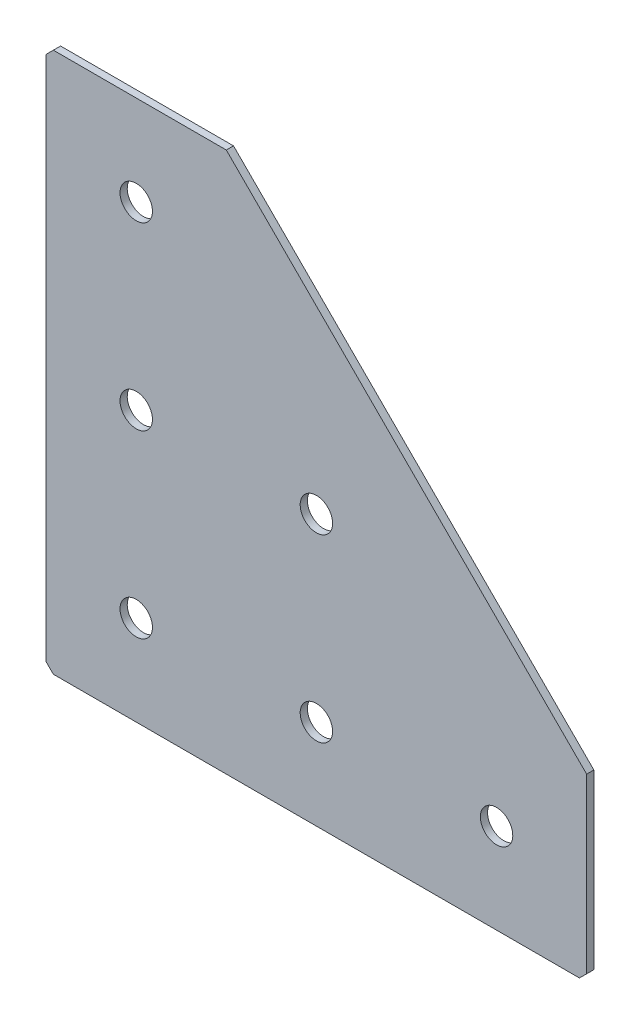
ISO-10303-21;
HEADER;
FILE_DESCRIPTION(('STEP AP214'),'2;1');
FILE_NAME('part.step','',(''),(''),'','','');
FILE_SCHEMA(('AUTOMOTIVE_DESIGN { 1 0 10303 214 1 1 1 1 }'));
ENDSEC;
DATA;
#1=APPLICATION_CONTEXT('core data for automotive mechanical design processes');
#2=APPLICATION_PROTOCOL_DEFINITION('international standard','automotive_design',2000,#1);
#3=PRODUCT_CONTEXT('',#1,'mechanical');
#4=PRODUCT('Part','Part','',(#3));
#5=PRODUCT_RELATED_PRODUCT_CATEGORY('part','',(#4));
#6=PRODUCT_DEFINITION_FORMATION('','',#4);
#7=PRODUCT_DEFINITION_CONTEXT('part definition',#1,'design');
#8=PRODUCT_DEFINITION('design','',#6,#7);
#9=PRODUCT_DEFINITION_SHAPE('','',#8);
#10=(LENGTH_UNIT() NAMED_UNIT(*) SI_UNIT(.MILLI.,.METRE.));
#11=(NAMED_UNIT(*) PLANE_ANGLE_UNIT() SI_UNIT($,.RADIAN.));
#12=(NAMED_UNIT(*) SI_UNIT($,.STERADIAN.) SOLID_ANGLE_UNIT());
#13=UNCERTAINTY_MEASURE_WITH_UNIT(LENGTH_MEASURE(1.E-05),#10,'distance_accuracy_value','');
#14=(GEOMETRIC_REPRESENTATION_CONTEXT(3) GLOBAL_UNCERTAINTY_ASSIGNED_CONTEXT((#13)) GLOBAL_UNIT_ASSIGNED_CONTEXT((#10,
#11,#12)) REPRESENTATION_CONTEXT('',''));
#15=CARTESIAN_POINT('',(0.,0.,0.));
#16=DIRECTION('',(0.,0.,1.));
#17=DIRECTION('',(1.,0.,0.));
#18=AXIS2_PLACEMENT_3D('',#15,#16,#17);
#19=CARTESIAN_POINT('',(50.,0.,-2.));
#20=DIRECTION('',(0.,-1.,0.));
#21=DIRECTION('',(1.,0.,0.));
#22=AXIS2_PLACEMENT_3D('',#19,#20,#21);
#23=PLANE('',#22);
#24=DIRECTION('',(1.,0.,0.));
#25=VECTOR('',#24,1.);
#26=CARTESIAN_POINT('',(50.,0.,-2.));
#27=LINE('',#26,#25);
#28=CARTESIAN_POINT('',(2.,0.,-2.));
#29=VERTEX_POINT('',#28);
#30=CARTESIAN_POINT('',(50.,0.,-2.));
#31=VERTEX_POINT('',#30);
#32=EDGE_CURVE('E112',#29,#31,#27,.T.);
#33=ORIENTED_EDGE('',*,*,#32,.F.);
#34=DIRECTION('',(0.,0.,1.));
#35=VECTOR('',#34,1.);
#36=CARTESIAN_POINT('',(2.,0.,-2.));
#37=LINE('',#36,#35);
#38=CARTESIAN_POINT('',(2.,0.,0.));
#39=VERTEX_POINT('',#38);
#40=EDGE_CURVE('E141',#29,#39,#37,.T.);
#41=ORIENTED_EDGE('',*,*,#40,.T.);
#42=DIRECTION('',(1.,0.,0.));
#43=VECTOR('',#42,1.);
#44=CARTESIAN_POINT('',(50.,0.,0.));
#45=LINE('',#44,#43);
#46=CARTESIAN_POINT('',(50.,0.,0.));
#47=VERTEX_POINT('',#46);
#48=EDGE_CURVE('E138',#39,#47,#45,.T.);
#49=ORIENTED_EDGE('',*,*,#48,.T.);
#50=DIRECTION('',(0.,0.,1.));
#51=VECTOR('',#50,1.);
#52=CARTESIAN_POINT('',(50.,0.,-2.));
#53=LINE('',#52,#51);
#54=EDGE_CURVE('E130',#31,#47,#53,.T.);
#55=ORIENTED_EDGE('',*,*,#54,.F.);
#56=EDGE_LOOP('',(#33,#41,#49,#55));
#57=FACE_BOUND('',#56,.T.);
#58=ADVANCED_FACE('F47',(#57),#23,.F.);
#59=CARTESIAN_POINT('',(150.,-100.,-2.));
#60=DIRECTION('',(-0.707106781186548,-0.707106781186548,0.));
#61=DIRECTION('',(0.707106781186548,-0.707106781186547,0.));
#62=AXIS2_PLACEMENT_3D('',#59,#60,#61);
#63=PLANE('',#62);
#64=DIRECTION('',(0.707106781186547,-0.707106781186547,0.));
#65=VECTOR('',#64,1.);
#66=CARTESIAN_POINT('',(150.,-100.,0.));
#67=LINE('',#66,#65);
#68=CARTESIAN_POINT('',(150.,-100.,0.));
#69=VERTEX_POINT('',#68);
#70=EDGE_CURVE('E199',#47,#69,#67,.T.);
#71=ORIENTED_EDGE('',*,*,#70,.T.);
#72=DIRECTION('',(0.,0.,1.));
#73=VECTOR('',#72,1.);
#74=CARTESIAN_POINT('',(150.,-100.,-2.));
#75=LINE('',#74,#73);
#76=CARTESIAN_POINT('',(150.,-100.,-2.));
#77=VERTEX_POINT('',#76);
#78=EDGE_CURVE('E132',#77,#69,#75,.T.);
#79=ORIENTED_EDGE('',*,*,#78,.F.);
#80=DIRECTION('',(0.707106781186547,-0.707106781186547,0.));
#81=VECTOR('',#80,1.);
#82=CARTESIAN_POINT('',(150.,-100.,-2.));
#83=LINE('',#82,#81);
#84=EDGE_CURVE('E116',#31,#77,#83,.T.);
#85=ORIENTED_EDGE('',*,*,#84,.F.);
#86=ORIENTED_EDGE('',*,*,#54,.T.);
#87=EDGE_LOOP('',(#71,#79,#85,#86));
#88=FACE_BOUND('',#87,.T.);
#89=ADVANCED_FACE('F129',(#88),#63,.F.);
#90=CARTESIAN_POINT('',(150.,-150.,-2.));
#91=DIRECTION('',(-1.,0.,0.));
#92=DIRECTION('',(0.,-1.,0.));
#93=AXIS2_PLACEMENT_3D('',#90,#91,#92);
#94=PLANE('',#93);
#95=DIRECTION('',(0.,-1.,0.));
#96=VECTOR('',#95,1.);
#97=CARTESIAN_POINT('',(150.,-150.,0.));
#98=LINE('',#97,#96);
#99=CARTESIAN_POINT('',(150.,-148.,0.));
#100=VERTEX_POINT('',#99);
#101=EDGE_CURVE('E192',#69,#100,#98,.T.);
#102=ORIENTED_EDGE('',*,*,#101,.T.);
#103=DIRECTION('',(0.,0.,-1.));
#104=VECTOR('',#103,1.);
#105=CARTESIAN_POINT('',(150.,-148.,-2.));
#106=LINE('',#105,#104);
#107=CARTESIAN_POINT('',(150.,-148.,-2.));
#108=VERTEX_POINT('',#107);
#109=EDGE_CURVE('E11',#100,#108,#106,.T.);
#110=ORIENTED_EDGE('',*,*,#109,.T.);
#111=DIRECTION('',(0.,-1.,0.));
#112=VECTOR('',#111,1.);
#113=CARTESIAN_POINT('',(150.,-150.,-2.));
#114=LINE('',#113,#112);
#115=EDGE_CURVE('E135',#77,#108,#114,.T.);
#116=ORIENTED_EDGE('',*,*,#115,.F.);
#117=ORIENTED_EDGE('',*,*,#78,.T.);
#118=EDGE_LOOP('',(#102,#110,#116,#117));
#119=FACE_BOUND('',#118,.T.);
#120=ADVANCED_FACE('F299',(#119),#94,.F.);
#121=CARTESIAN_POINT('',(0.,-150.,-2.));
#122=DIRECTION('',(0.,1.,0.));
#123=DIRECTION('',(0.,0.,1.));
#124=AXIS2_PLACEMENT_3D('',#121,#122,#123);
#125=PLANE('',#124);
#126=DIRECTION('',(-1.,0.,0.));
#127=VECTOR('',#126,1.);
#128=CARTESIAN_POINT('',(0.,-150.,-2.));
#129=LINE('',#128,#127);
#130=CARTESIAN_POINT('',(148.,-150.,-2.));
#131=VERTEX_POINT('',#130);
#132=CARTESIAN_POINT('',(2.,-150.,-2.));
#133=VERTEX_POINT('',#132);
#134=EDGE_CURVE('E184',#131,#133,#129,.T.);
#135=ORIENTED_EDGE('',*,*,#134,.F.);
#136=DIRECTION('',(0.,0.,1.));
#137=VECTOR('',#136,1.);
#138=CARTESIAN_POINT('',(148.,-150.,-2.));
#139=LINE('',#138,#137);
#140=CARTESIAN_POINT('',(148.,-150.,0.));
#141=VERTEX_POINT('',#140);
#142=EDGE_CURVE('E56',#131,#141,#139,.T.);
#143=ORIENTED_EDGE('',*,*,#142,.T.);
#144=DIRECTION('',(-1.,0.,0.));
#145=VECTOR('',#144,1.);
#146=CARTESIAN_POINT('',(0.,-150.,0.));
#147=LINE('',#146,#145);
#148=CARTESIAN_POINT('',(2.,-150.,0.));
#149=VERTEX_POINT('',#148);
#150=EDGE_CURVE('E183',#141,#149,#147,.T.);
#151=ORIENTED_EDGE('',*,*,#150,.T.);
#152=DIRECTION('',(0.,0.,-1.));
#153=VECTOR('',#152,1.);
#154=CARTESIAN_POINT('',(2.,-150.,-2.));
#155=LINE('',#154,#153);
#156=EDGE_CURVE('E63',#149,#133,#155,.T.);
#157=ORIENTED_EDGE('',*,*,#156,.T.);
#158=EDGE_LOOP('',(#135,#143,#151,#157));
#159=FACE_BOUND('',#158,.T.);
#160=ADVANCED_FACE('F182',(#159),#125,.F.);
#161=CARTESIAN_POINT('',(0.,0.,-2.));
#162=DIRECTION('',(1.,0.,0.));
#163=DIRECTION('',(0.,0.,-1.));
#164=AXIS2_PLACEMENT_3D('',#161,#162,#163);
#165=PLANE('',#164);
#166=DIRECTION('',(0.,1.,0.));
#167=VECTOR('',#166,1.);
#168=CARTESIAN_POINT('',(0.,0.,0.));
#169=LINE('',#168,#167);
#170=CARTESIAN_POINT('',(0.,-148.,0.));
#171=VERTEX_POINT('',#170);
#172=CARTESIAN_POINT('',(0.,-2.00000000000003,0.));
#173=VERTEX_POINT('',#172);
#174=EDGE_CURVE('E125',#171,#173,#169,.T.);
#175=ORIENTED_EDGE('',*,*,#174,.T.);
#176=DIRECTION('',(0.,0.,-1.));
#177=VECTOR('',#176,1.);
#178=CARTESIAN_POINT('',(0.,-2.00000000000003,-2.));
#179=LINE('',#178,#177);
#180=CARTESIAN_POINT('',(0.,-2.00000000000003,-2.));
#181=VERTEX_POINT('',#180);
#182=EDGE_CURVE('E165',#173,#181,#179,.T.);
#183=ORIENTED_EDGE('',*,*,#182,.T.);
#184=DIRECTION('',(0.,1.,0.));
#185=VECTOR('',#184,1.);
#186=CARTESIAN_POINT('',(0.,0.,-2.));
#187=LINE('',#186,#185);
#188=CARTESIAN_POINT('',(0.,-148.,-2.));
#189=VERTEX_POINT('',#188);
#190=EDGE_CURVE('E149',#189,#181,#187,.T.);
#191=ORIENTED_EDGE('',*,*,#190,.F.);
#192=DIRECTION('',(0.,0.,1.));
#193=VECTOR('',#192,1.);
#194=CARTESIAN_POINT('',(0.,-148.,-2.));
#195=LINE('',#194,#193);
#196=EDGE_CURVE('E161',#189,#171,#195,.T.);
#197=ORIENTED_EDGE('',*,*,#196,.T.);
#198=EDGE_LOOP('',(#175,#183,#191,#197));
#199=FACE_BOUND('',#198,.T.);
#200=ADVANCED_FACE('F267',(#199),#165,.F.);
#201=CARTESIAN_POINT('',(0.,0.,-2.));
#202=DIRECTION('',(0.,0.,1.));
#203=DIRECTION('',(1.,0.,0.));
#204=AXIS2_PLACEMENT_3D('',#201,#202,#203);
#205=PLANE('',#204);
#206=CARTESIAN_POINT('',(75.,-125.,-2.00000000000001));
#207=DIRECTION('',(0.,0.,-1.));
#208=DIRECTION('',(0.,1.,0.));
#209=AXIS2_PLACEMENT_3D('',#206,#207,#208);
#210=CIRCLE('',#209,4.5);
#211=CARTESIAN_POINT('',(75.,-120.5,-2.00000000000001));
#212=VERTEX_POINT('',#211);
#213=EDGE_CURVE('E256',#212,#212,#210,.T.);
#214=ORIENTED_EDGE('',*,*,#213,.F.);
#215=EDGE_LOOP('',(#214));
#216=FACE_BOUND('',#215,.T.);
#217=CARTESIAN_POINT('',(25.,-125.,-2.00000000000001));
#218=DIRECTION('',(0.,0.,-1.));
#219=DIRECTION('',(0.,1.,0.));
#220=AXIS2_PLACEMENT_3D('',#217,#218,#219);
#221=CIRCLE('',#220,4.5);
#222=CARTESIAN_POINT('',(25.,-120.5,-2.00000000000001));
#223=VERTEX_POINT('',#222);
#224=EDGE_CURVE('E248',#223,#223,#221,.T.);
#225=ORIENTED_EDGE('',*,*,#224,.F.);
#226=EDGE_LOOP('',(#225));
#227=FACE_BOUND('',#226,.T.);
#228=CARTESIAN_POINT('',(25.,-75.,-2.));
#229=DIRECTION('',(0.,0.,-1.));
#230=DIRECTION('',(0.,1.,0.));
#231=AXIS2_PLACEMENT_3D('',#228,#229,#230);
#232=CIRCLE('',#231,4.5);
#233=CARTESIAN_POINT('',(25.,-70.5,-2.));
#234=VERTEX_POINT('',#233);
#235=EDGE_CURVE('E240',#234,#234,#232,.T.);
#236=ORIENTED_EDGE('',*,*,#235,.F.);
#237=EDGE_LOOP('',(#236));
#238=FACE_BOUND('',#237,.T.);
#239=CARTESIAN_POINT('',(25.,-25.,-2.));
#240=DIRECTION('',(0.,0.,-1.));
#241=DIRECTION('',(0.,1.,0.));
#242=AXIS2_PLACEMENT_3D('',#239,#240,#241);
#243=CIRCLE('',#242,4.5);
#244=CARTESIAN_POINT('',(25.,-20.5,-2.));
#245=VERTEX_POINT('',#244);
#246=EDGE_CURVE('E232',#245,#245,#243,.T.);
#247=ORIENTED_EDGE('',*,*,#246,.F.);
#248=EDGE_LOOP('',(#247));
#249=FACE_BOUND('',#248,.T.);
#250=CARTESIAN_POINT('',(125.,-125.,-2.00000000000001));
#251=DIRECTION('',(0.,0.,-1.));
#252=DIRECTION('',(0.,1.,0.));
#253=AXIS2_PLACEMENT_3D('',#250,#251,#252);
#254=CIRCLE('',#253,4.5);
#255=CARTESIAN_POINT('',(125.,-120.5,-2.00000000000001));
#256=VERTEX_POINT('',#255);
#257=EDGE_CURVE('E224',#256,#256,#254,.T.);
#258=ORIENTED_EDGE('',*,*,#257,.F.);
#259=EDGE_LOOP('',(#258));
#260=FACE_BOUND('',#259,.T.);
#261=CARTESIAN_POINT('',(75.,-75.,-2.));
#262=DIRECTION('',(0.,0.,-1.));
#263=DIRECTION('',(0.,1.,0.));
#264=AXIS2_PLACEMENT_3D('',#261,#262,#263);
#265=CIRCLE('',#264,4.5);
#266=CARTESIAN_POINT('',(75.,-70.5,-2.));
#267=VERTEX_POINT('',#266);
#268=EDGE_CURVE('E216',#267,#267,#265,.T.);
#269=ORIENTED_EDGE('',*,*,#268,.F.);
#270=EDGE_LOOP('',(#269));
#271=FACE_BOUND('',#270,.T.);
#272=ORIENTED_EDGE('',*,*,#190,.T.);
#273=DIRECTION('',(-0.707106781186543,-0.707106781186552,0.));
#274=VECTOR('',#273,1.);
#275=CARTESIAN_POINT('',(2.,0.,-2.));
#276=LINE('',#275,#274);
#277=EDGE_CURVE('E119',#181,#29,#276,.F.);
#278=ORIENTED_EDGE('',*,*,#277,.T.);
#279=ORIENTED_EDGE('',*,*,#32,.T.);
#280=ORIENTED_EDGE('',*,*,#84,.T.);
#281=ORIENTED_EDGE('',*,*,#115,.T.);
#282=DIRECTION('',(0.707106781186548,0.707106781186548,0.));
#283=VECTOR('',#282,1.);
#284=CARTESIAN_POINT('',(148.,-150.,-2.));
#285=LINE('',#284,#283);
#286=EDGE_CURVE('E70',#108,#131,#285,.F.);
#287=ORIENTED_EDGE('',*,*,#286,.T.);
#288=ORIENTED_EDGE('',*,*,#134,.T.);
#289=DIRECTION('',(0.707106781186548,-0.707106781186548,0.));
#290=VECTOR('',#289,1.);
#291=CARTESIAN_POINT('',(0.,-148.,-2.));
#292=LINE('',#291,#290);
#293=EDGE_CURVE('E168',#133,#189,#292,.F.);
#294=ORIENTED_EDGE('',*,*,#293,.T.);
#295=EDGE_LOOP('',(#272,#278,#279,#280,#281,#287,#288,#294));
#296=FACE_BOUND('',#295,.T.);
#297=ADVANCED_FACE('F115',(#216,#227,#238,#249,#260,#271,#296),#205,.F.);
#298=CARTESIAN_POINT('',(0.,0.,0.));
#299=DIRECTION('',(0.,0.,1.));
#300=DIRECTION('',(1.,0.,0.));
#301=AXIS2_PLACEMENT_3D('',#298,#299,#300);
#302=PLANE('',#301);
#303=CARTESIAN_POINT('',(75.,-125.,0.));
#304=DIRECTION('',(0.,0.,-1.));
#305=DIRECTION('',(0.,1.,0.));
#306=AXIS2_PLACEMENT_3D('',#303,#304,#305);
#307=CIRCLE('',#306,4.5);
#308=CARTESIAN_POINT('',(75.,-120.5,0.));
#309=VERTEX_POINT('',#308);
#310=EDGE_CURVE('E252',#309,#309,#307,.T.);
#311=ORIENTED_EDGE('',*,*,#310,.T.);
#312=EDGE_LOOP('',(#311));
#313=FACE_BOUND('',#312,.T.);
#314=CARTESIAN_POINT('',(25.,-125.,0.));
#315=DIRECTION('',(0.,0.,-1.));
#316=DIRECTION('',(0.,1.,0.));
#317=AXIS2_PLACEMENT_3D('',#314,#315,#316);
#318=CIRCLE('',#317,4.5);
#319=CARTESIAN_POINT('',(25.,-120.5,0.));
#320=VERTEX_POINT('',#319);
#321=EDGE_CURVE('E244',#320,#320,#318,.T.);
#322=ORIENTED_EDGE('',*,*,#321,.T.);
#323=EDGE_LOOP('',(#322));
#324=FACE_BOUND('',#323,.T.);
#325=CARTESIAN_POINT('',(25.,-75.,0.));
#326=DIRECTION('',(0.,0.,-1.));
#327=DIRECTION('',(0.,1.,0.));
#328=AXIS2_PLACEMENT_3D('',#325,#326,#327);
#329=CIRCLE('',#328,4.5);
#330=CARTESIAN_POINT('',(25.,-70.5,0.));
#331=VERTEX_POINT('',#330);
#332=EDGE_CURVE('E236',#331,#331,#329,.T.);
#333=ORIENTED_EDGE('',*,*,#332,.T.);
#334=EDGE_LOOP('',(#333));
#335=FACE_BOUND('',#334,.T.);
#336=CARTESIAN_POINT('',(25.,-25.,0.));
#337=DIRECTION('',(0.,0.,-1.));
#338=DIRECTION('',(0.,1.,0.));
#339=AXIS2_PLACEMENT_3D('',#336,#337,#338);
#340=CIRCLE('',#339,4.5);
#341=CARTESIAN_POINT('',(25.,-20.5,0.));
#342=VERTEX_POINT('',#341);
#343=EDGE_CURVE('E228',#342,#342,#340,.T.);
#344=ORIENTED_EDGE('',*,*,#343,.T.);
#345=EDGE_LOOP('',(#344));
#346=FACE_BOUND('',#345,.T.);
#347=CARTESIAN_POINT('',(125.,-125.,0.));
#348=DIRECTION('',(0.,0.,-1.));
#349=DIRECTION('',(0.,1.,0.));
#350=AXIS2_PLACEMENT_3D('',#347,#348,#349);
#351=CIRCLE('',#350,4.5);
#352=CARTESIAN_POINT('',(125.,-120.5,0.));
#353=VERTEX_POINT('',#352);
#354=EDGE_CURVE('E220',#353,#353,#351,.T.);
#355=ORIENTED_EDGE('',*,*,#354,.T.);
#356=EDGE_LOOP('',(#355));
#357=FACE_BOUND('',#356,.T.);
#358=CARTESIAN_POINT('',(75.,-75.,0.));
#359=DIRECTION('',(0.,0.,-1.));
#360=DIRECTION('',(0.,1.,0.));
#361=AXIS2_PLACEMENT_3D('',#358,#359,#360);
#362=CIRCLE('',#361,4.5);
#363=CARTESIAN_POINT('',(75.,-70.5,0.));
#364=VERTEX_POINT('',#363);
#365=EDGE_CURVE('E206',#364,#364,#362,.T.);
#366=ORIENTED_EDGE('',*,*,#365,.T.);
#367=EDGE_LOOP('',(#366));
#368=FACE_BOUND('',#367,.T.);
#369=ORIENTED_EDGE('',*,*,#48,.F.);
#370=DIRECTION('',(0.707106781186543,0.707106781186552,0.));
#371=VECTOR('',#370,1.);
#372=CARTESIAN_POINT('',(1.00000000000001,-1.,0.));
#373=LINE('',#372,#371);
#374=EDGE_CURVE('E158',#39,#173,#373,.F.);
#375=ORIENTED_EDGE('',*,*,#374,.T.);
#376=ORIENTED_EDGE('',*,*,#174,.F.);
#377=DIRECTION('',(-0.707106781186548,0.707106781186548,0.));
#378=VECTOR('',#377,1.);
#379=CARTESIAN_POINT('',(-74.,-74.,0.));
#380=LINE('',#379,#378);
#381=EDGE_CURVE('E147',#171,#149,#380,.F.);
#382=ORIENTED_EDGE('',*,*,#381,.T.);
#383=ORIENTED_EDGE('',*,*,#150,.F.);
#384=DIRECTION('',(-0.707106781186548,-0.707106781186548,0.));
#385=VECTOR('',#384,1.);
#386=CARTESIAN_POINT('',(149.,-149.,0.));
#387=LINE('',#386,#385);
#388=EDGE_CURVE('E155',#141,#100,#387,.F.);
#389=ORIENTED_EDGE('',*,*,#388,.T.);
#390=ORIENTED_EDGE('',*,*,#101,.F.);
#391=ORIENTED_EDGE('',*,*,#70,.F.);
#392=EDGE_LOOP('',(#369,#375,#376,#382,#383,#389,#390,#391));
#393=FACE_BOUND('',#392,.T.);
#394=ADVANCED_FACE('F187',(#313,#324,#335,#346,#357,#368,#393),#302,.T.);
#395=CARTESIAN_POINT('',(75.,-75.,-2.));
#396=DIRECTION('',(0.,0.,-1.));
#397=DIRECTION('',(0.,1.,0.));
#398=AXIS2_PLACEMENT_3D('',#395,#396,#397);
#399=CYLINDRICAL_SURFACE('',#398,4.5);
#400=ORIENTED_EDGE('',*,*,#365,.F.);
#401=EDGE_LOOP('',(#400));
#402=FACE_BOUND('',#401,.T.);
#403=ORIENTED_EDGE('',*,*,#268,.T.);
#404=EDGE_LOOP('',(#403));
#405=FACE_BOUND('',#404,.T.);
#406=ADVANCED_FACE('F279',(#402,#405),#399,.F.);
#407=CARTESIAN_POINT('',(125.,-125.,-2.00000000000001));
#408=DIRECTION('',(0.,0.,-1.));
#409=DIRECTION('',(0.,1.,0.));
#410=AXIS2_PLACEMENT_3D('',#407,#408,#409);
#411=CYLINDRICAL_SURFACE('',#410,4.5);
#412=ORIENTED_EDGE('',*,*,#354,.F.);
#413=EDGE_LOOP('',(#412));
#414=FACE_BOUND('',#413,.T.);
#415=ORIENTED_EDGE('',*,*,#257,.T.);
#416=EDGE_LOOP('',(#415));
#417=FACE_BOUND('',#416,.T.);
#418=ADVANCED_FACE('F281',(#414,#417),#411,.F.);
#419=CARTESIAN_POINT('',(25.,-25.,-2.));
#420=DIRECTION('',(0.,0.,-1.));
#421=DIRECTION('',(0.,1.,0.));
#422=AXIS2_PLACEMENT_3D('',#419,#420,#421);
#423=CYLINDRICAL_SURFACE('',#422,4.5);
#424=ORIENTED_EDGE('',*,*,#343,.F.);
#425=EDGE_LOOP('',(#424));
#426=FACE_BOUND('',#425,.T.);
#427=ORIENTED_EDGE('',*,*,#246,.T.);
#428=EDGE_LOOP('',(#427));
#429=FACE_BOUND('',#428,.T.);
#430=ADVANCED_FACE('F288',(#426,#429),#423,.F.);
#431=CARTESIAN_POINT('',(25.,-75.,-2.));
#432=DIRECTION('',(0.,0.,-1.));
#433=DIRECTION('',(0.,1.,0.));
#434=AXIS2_PLACEMENT_3D('',#431,#432,#433);
#435=CYLINDRICAL_SURFACE('',#434,4.5);
#436=ORIENTED_EDGE('',*,*,#332,.F.);
#437=EDGE_LOOP('',(#436));
#438=FACE_BOUND('',#437,.T.);
#439=ORIENTED_EDGE('',*,*,#235,.T.);
#440=EDGE_LOOP('',(#439));
#441=FACE_BOUND('',#440,.T.);
#442=ADVANCED_FACE('F363',(#438,#441),#435,.F.);
#443=CARTESIAN_POINT('',(25.,-125.,-2.00000000000001));
#444=DIRECTION('',(0.,0.,-1.));
#445=DIRECTION('',(0.,1.,0.));
#446=AXIS2_PLACEMENT_3D('',#443,#444,#445);
#447=CYLINDRICAL_SURFACE('',#446,4.5);
#448=ORIENTED_EDGE('',*,*,#321,.F.);
#449=EDGE_LOOP('',(#448));
#450=FACE_BOUND('',#449,.T.);
#451=ORIENTED_EDGE('',*,*,#224,.T.);
#452=EDGE_LOOP('',(#451));
#453=FACE_BOUND('',#452,.T.);
#454=ADVANCED_FACE('F372',(#450,#453),#447,.F.);
#455=CARTESIAN_POINT('',(75.,-125.,-2.00000000000001));
#456=DIRECTION('',(0.,0.,-1.));
#457=DIRECTION('',(0.,1.,0.));
#458=AXIS2_PLACEMENT_3D('',#455,#456,#457);
#459=CYLINDRICAL_SURFACE('',#458,4.5);
#460=ORIENTED_EDGE('',*,*,#310,.F.);
#461=EDGE_LOOP('',(#460));
#462=FACE_BOUND('',#461,.T.);
#463=ORIENTED_EDGE('',*,*,#213,.T.);
#464=EDGE_LOOP('',(#463));
#465=FACE_BOUND('',#464,.T.);
#466=ADVANCED_FACE('F263',(#462,#465),#459,.F.);
#467=CARTESIAN_POINT('',(2.,0.,-2.));
#468=DIRECTION('',(0.707106781186552,-0.707106781186542,0.));
#469=DIRECTION('',(0.,0.,1.));
#470=AXIS2_PLACEMENT_3D('',#467,#468,#469);
#471=PLANE('',#470);
#472=ORIENTED_EDGE('',*,*,#277,.F.);
#473=ORIENTED_EDGE('',*,*,#182,.F.);
#474=ORIENTED_EDGE('',*,*,#374,.F.);
#475=ORIENTED_EDGE('',*,*,#40,.F.);
#476=EDGE_LOOP('',(#472,#473,#474,#475));
#477=FACE_BOUND('',#476,.T.);
#478=ADVANCED_FACE('F303',(#477),#471,.F.);
#479=CARTESIAN_POINT('',(148.,-150.,-2.));
#480=DIRECTION('',(-0.707106781186547,0.707106781186547,0.));
#481=DIRECTION('',(0.,0.,1.));
#482=AXIS2_PLACEMENT_3D('',#479,#480,#481);
#483=PLANE('',#482);
#484=ORIENTED_EDGE('',*,*,#286,.F.);
#485=ORIENTED_EDGE('',*,*,#109,.F.);
#486=ORIENTED_EDGE('',*,*,#388,.F.);
#487=ORIENTED_EDGE('',*,*,#142,.F.);
#488=EDGE_LOOP('',(#484,#485,#486,#487));
#489=FACE_BOUND('',#488,.T.);
#490=ADVANCED_FACE('F305',(#489),#483,.F.);
#491=CARTESIAN_POINT('',(0.,-148.,-2.));
#492=DIRECTION('',(0.707106781186547,0.707106781186547,0.));
#493=DIRECTION('',(0.,0.,1.));
#494=AXIS2_PLACEMENT_3D('',#491,#492,#493);
#495=PLANE('',#494);
#496=ORIENTED_EDGE('',*,*,#293,.F.);
#497=ORIENTED_EDGE('',*,*,#156,.F.);
#498=ORIENTED_EDGE('',*,*,#381,.F.);
#499=ORIENTED_EDGE('',*,*,#196,.F.);
#500=EDGE_LOOP('',(#496,#497,#498,#499));
#501=FACE_BOUND('',#500,.T.);
#502=ADVANCED_FACE('F49',(#501),#495,.F.);
#503=CLOSED_SHELL('',(#58,#89,#120,#160,#200,#297,#394,#406,#418,#430,#442,#454,#466,#478,#490,#502));
#504=MANIFOLD_SOLID_BREP('B2',#503);
#505=ADVANCED_BREP_SHAPE_REPRESENTATION('',(#18,#504),#14);
#506=SHAPE_DEFINITION_REPRESENTATION(#9,#505);
ENDSEC;
END-ISO-10303-21;
